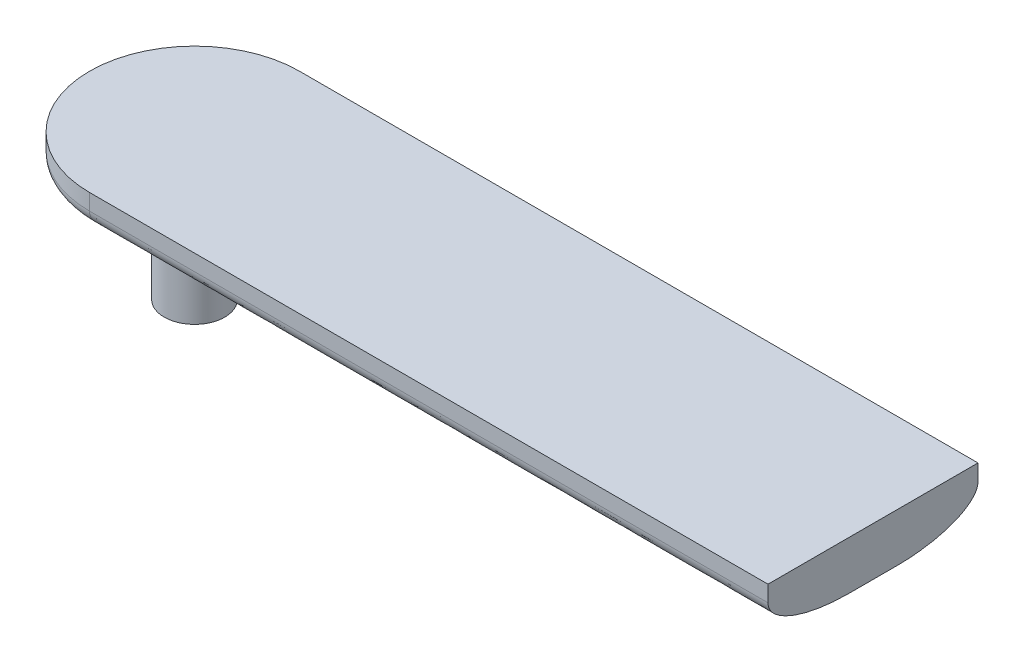
ISO-10303-21;
HEADER;
FILE_DESCRIPTION(('STEP AP214'),'2;1');
FILE_NAME('part.step','',(''),(''),'','','');
FILE_SCHEMA(('AUTOMOTIVE_DESIGN { 1 0 10303 214 1 1 1 1 }'));
ENDSEC;
DATA;
#1=APPLICATION_CONTEXT('core data for automotive mechanical design processes');
#2=APPLICATION_PROTOCOL_DEFINITION('international standard','automotive_design',2000,#1);
#3=PRODUCT_CONTEXT('',#1,'mechanical');
#4=PRODUCT('Part','Part','',(#3));
#5=PRODUCT_RELATED_PRODUCT_CATEGORY('part','',(#4));
#6=PRODUCT_DEFINITION_FORMATION('','',#4);
#7=PRODUCT_DEFINITION_CONTEXT('part definition',#1,'design');
#8=PRODUCT_DEFINITION('design','',#6,#7);
#9=PRODUCT_DEFINITION_SHAPE('','',#8);
#10=(LENGTH_UNIT() NAMED_UNIT(*) SI_UNIT(.MILLI.,.METRE.));
#11=(NAMED_UNIT(*) PLANE_ANGLE_UNIT() SI_UNIT($,.RADIAN.));
#12=(NAMED_UNIT(*) SI_UNIT($,.STERADIAN.) SOLID_ANGLE_UNIT());
#13=UNCERTAINTY_MEASURE_WITH_UNIT(LENGTH_MEASURE(1.E-05),#10,'distance_accuracy_value','');
#14=(GEOMETRIC_REPRESENTATION_CONTEXT(3) GLOBAL_UNCERTAINTY_ASSIGNED_CONTEXT((#13)) GLOBAL_UNIT_ASSIGNED_CONTEXT((#10,
#11,#12)) REPRESENTATION_CONTEXT('',''));
#15=CARTESIAN_POINT('',(0.,0.,0.));
#16=DIRECTION('',(0.,0.,1.));
#17=DIRECTION('',(1.,0.,0.));
#18=AXIS2_PLACEMENT_3D('',#15,#16,#17);
#19=CARTESIAN_POINT('',(0.,3.,0.));
#20=DIRECTION('',(0.,-1.,0.));
#21=DIRECTION('',(0.,0.,-1.));
#22=AXIS2_PLACEMENT_3D('',#19,#20,#21);
#23=CYLINDRICAL_SURFACE('',#22,6.50000000000001);
#24=DIRECTION('',(0.,-1.,0.));
#25=VECTOR('',#24,1.);
#26=CARTESIAN_POINT('',(0.,3.,-6.50000000000001));
#27=LINE('',#26,#25);
#28=CARTESIAN_POINT('',(0.,3.,-6.50000000000001));
#29=VERTEX_POINT('',#28);
#30=CARTESIAN_POINT('',(0.,2.,-6.50000000000001));
#31=VERTEX_POINT('',#30);
#32=EDGE_CURVE('E211',#29,#31,#27,.T.);
#33=ORIENTED_EDGE('',*,*,#32,.T.);
#34=CARTESIAN_POINT('',(0.,2.,6.50000000000001));
#35=CARTESIAN_POINT('',(-0.851001372194236,2.,6.50000000000001));
#36=CARTESIAN_POINT('',(-1.70136130656355,2.,6.33082237422514));
#37=CARTESIAN_POINT('',(-3.27352331418263,2.,5.6796115484216));
#38=CARTESIAN_POINT('',(-3.994553724403,2.,5.19783443102213));
#39=CARTESIAN_POINT('',(-5.19783443102215,2.,3.99455372440297));
#40=CARTESIAN_POINT('',(-5.67961154842164,2.,3.27352331418254));
#41=CARTESIAN_POINT('',(-6.33082237422511,2.,1.70136130656361));
#42=CARTESIAN_POINT('',(-6.50000000000001,2.,0.850847947321459));
#43=CARTESIAN_POINT('',(-6.50000000000001,2.,-0.850847947321462));
#44=CARTESIAN_POINT('',(-6.3308223742251,2.,-1.70136130656364));
#45=CARTESIAN_POINT('',(-5.67961154842162,2.,-3.27352331418256));
#46=CARTESIAN_POINT('',(-5.19783443102222,2.,-3.9945537244029));
#47=CARTESIAN_POINT('',(-3.99455372440289,2.,-5.19783443102223));
#48=CARTESIAN_POINT('',(-3.27352331418265,2.,-5.67961154842159));
#49=CARTESIAN_POINT('',(-1.70136130656348,2.,-6.33082237422516));
#50=CARTESIAN_POINT('',(-0.851001372194256,2.,-6.50000000000001));
#51=CARTESIAN_POINT('',(0.,2.,-6.50000000000001));
#52=(BOUNDED_CURVE() B_SPLINE_CURVE(3,(#34,#35,#36,#37,#38,#39,#40,#41,#42,#43,#44,#45,#46,#47,
#48,#49,#50,#51),.UNSPECIFIED.,.F.,.F.) B_SPLINE_CURVE_WITH_KNOTS((4,2,2,2,2,2,2,2,4),
(3.14159265358979,3.53429173528852,3.92699081698724,4.31968989868597,4.71238898038469,
5.10508806208341,5.49778714378214,5.89048622548086,6.28318530717959),
.UNSPECIFIED.) CURVE() GEOMETRIC_REPRESENTATION_ITEM() RATIONAL_B_SPLINE_CURVE((1.,1.,1.,1.,1.,
1.,1.,1.,1.,1.,1.,1.,1.,1.,1.,1.,1.,1.)) REPRESENTATION_ITEM(''));
#53=CARTESIAN_POINT('',(0.,2.,6.50000000000001));
#54=VERTEX_POINT('',#53);
#55=EDGE_CURVE('E299',#31,#54,#52,.F.);
#56=ORIENTED_EDGE('',*,*,#55,.T.);
#57=DIRECTION('',(0.,-1.,0.));
#58=VECTOR('',#57,1.);
#59=CARTESIAN_POINT('',(0.,3.,6.50000000000001));
#60=LINE('',#59,#58);
#61=CARTESIAN_POINT('',(0.,3.,6.50000000000001));
#62=VERTEX_POINT('',#61);
#63=EDGE_CURVE('E264',#62,#54,#60,.T.);
#64=ORIENTED_EDGE('',*,*,#63,.F.);
#65=CARTESIAN_POINT('',(0.,3.,0.));
#66=DIRECTION('',(0.,1.,0.));
#67=DIRECTION('',(0.,0.,1.));
#68=AXIS2_PLACEMENT_3D('',#65,#66,#67);
#69=CIRCLE('',#68,6.50000000000001);
#70=EDGE_CURVE('E197',#29,#62,#69,.T.);
#71=ORIENTED_EDGE('',*,*,#70,.F.);
#72=EDGE_LOOP('',(#33,#56,#64,#71));
#73=FACE_BOUND('',#72,.T.);
#74=ADVANCED_FACE('F56',(#73),#23,.T.);
#75=CARTESIAN_POINT('',(0.,3.,6.50000000000001));
#76=DIRECTION('',(0.,0.,-1.));
#77=DIRECTION('',(-1.,0.,0.));
#78=AXIS2_PLACEMENT_3D('',#75,#76,#77);
#79=PLANE('',#78);
#80=ORIENTED_EDGE('',*,*,#63,.T.);
#81=CARTESIAN_POINT('',(44.1,2.,6.5));
#82=CARTESIAN_POINT('',(29.4,2.,6.5));
#83=CARTESIAN_POINT('',(14.7,2.,6.5));
#84=CARTESIAN_POINT('',(0.,2.,6.50000000000001));
#85=(BOUNDED_CURVE() B_SPLINE_CURVE(3,(#81,#82,#83,#84),.UNSPECIFIED.,.F.,
.F.) B_SPLINE_CURVE_WITH_KNOTS((4,4),(0.,0.0441),
.UNSPECIFIED.) CURVE() GEOMETRIC_REPRESENTATION_ITEM() RATIONAL_B_SPLINE_CURVE((1.,1.,1.,1.)) REPRESENTATION_ITEM(''));
#86=CARTESIAN_POINT('',(42.,2.,6.5));
#87=VERTEX_POINT('',#86);
#88=EDGE_CURVE('E71',#54,#87,#85,.F.);
#89=ORIENTED_EDGE('',*,*,#88,.T.);
#90=DIRECTION('',(0.,-1.,0.));
#91=VECTOR('',#90,1.);
#92=CARTESIAN_POINT('',(42.,3.,6.5));
#93=LINE('',#92,#91);
#94=CARTESIAN_POINT('',(42.,3.,6.5));
#95=VERTEX_POINT('',#94);
#96=EDGE_CURVE('E275',#95,#87,#93,.T.);
#97=ORIENTED_EDGE('',*,*,#96,.F.);
#98=DIRECTION('',(1.,0.,0.));
#99=VECTOR('',#98,1.);
#100=CARTESIAN_POINT('',(0.,3.,6.50000000000001));
#101=LINE('',#100,#99);
#102=EDGE_CURVE('E201',#62,#95,#101,.T.);
#103=ORIENTED_EDGE('',*,*,#102,.F.);
#104=EDGE_LOOP('',(#80,#89,#97,#103));
#105=FACE_BOUND('',#104,.T.);
#106=ADVANCED_FACE('F250',(#105),#79,.F.);
#107=CARTESIAN_POINT('',(42.,3.,-6.5));
#108=DIRECTION('',(-1.,0.,0.));
#109=DIRECTION('',(0.,0.,1.));
#110=AXIS2_PLACEMENT_3D('',#107,#108,#109);
#111=PLANE('',#110);
#112=DIRECTION('',(0.,0.,-1.));
#113=VECTOR('',#112,1.);
#114=CARTESIAN_POINT('',(42.,0.,-6.5));
#115=LINE('',#114,#113);
#116=CARTESIAN_POINT('',(42.,0.,1.49999999999999));
#117=VERTEX_POINT('',#116);
#118=CARTESIAN_POINT('',(42.,0.,-1.5));
#119=VERTEX_POINT('',#118);
#120=EDGE_CURVE('E202',#117,#119,#115,.T.);
#121=ORIENTED_EDGE('',*,*,#120,.T.);
#122=CARTESIAN_POINT('',(42.,2.,-6.5));
#123=CARTESIAN_POINT('',(42.,0.,-6.5));
#124=CARTESIAN_POINT('',(42.,0.,-1.5));
#125=(BOUNDED_CURVE() B_SPLINE_CURVE(2,(#122,#123,#124),.UNSPECIFIED.,.F.,
.F.) B_SPLINE_CURVE_WITH_KNOTS((3,3),(0.,1.),
.UNSPECIFIED.) CURVE() GEOMETRIC_REPRESENTATION_ITEM() RATIONAL_B_SPLINE_CURVE((1.,
0.707106781186547,1.)) REPRESENTATION_ITEM(''));
#126=CARTESIAN_POINT('',(42.,2.,-6.5));
#127=VERTEX_POINT('',#126);
#128=EDGE_CURVE('E128',#119,#127,#125,.F.);
#129=ORIENTED_EDGE('',*,*,#128,.T.);
#130=DIRECTION('',(0.,-1.,0.));
#131=VECTOR('',#130,1.);
#132=CARTESIAN_POINT('',(42.,3.,-6.5));
#133=LINE('',#132,#131);
#134=CARTESIAN_POINT('',(42.,3.,-6.5));
#135=VERTEX_POINT('',#134);
#136=EDGE_CURVE('E285',#135,#127,#133,.T.);
#137=ORIENTED_EDGE('',*,*,#136,.F.);
#138=DIRECTION('',(0.,0.,-1.));
#139=VECTOR('',#138,1.);
#140=CARTESIAN_POINT('',(42.,3.,-6.5));
#141=LINE('',#140,#139);
#142=EDGE_CURVE('E205',#95,#135,#141,.T.);
#143=ORIENTED_EDGE('',*,*,#142,.F.);
#144=ORIENTED_EDGE('',*,*,#96,.T.);
#145=CARTESIAN_POINT('',(42.,0.,1.5));
#146=CARTESIAN_POINT('',(42.,0.,6.50000000000012));
#147=CARTESIAN_POINT('',(42.,2.,6.5));
#148=(BOUNDED_CURVE() B_SPLINE_CURVE(2,(#145,#146,#147),.UNSPECIFIED.,.F.,
.F.) B_SPLINE_CURVE_WITH_KNOTS((3,3),(0.,1.),
.UNSPECIFIED.) CURVE() GEOMETRIC_REPRESENTATION_ITEM() RATIONAL_B_SPLINE_CURVE((1.,
0.707106781186548,1.)) REPRESENTATION_ITEM(''));
#149=EDGE_CURVE('E135',#87,#117,#148,.F.);
#150=ORIENTED_EDGE('',*,*,#149,.T.);
#151=EDGE_LOOP('',(#121,#129,#137,#143,#144,#150));
#152=FACE_BOUND('',#151,.T.);
#153=ADVANCED_FACE('F245',(#152),#111,.F.);
#154=CARTESIAN_POINT('',(0.,3.,-6.50000000000001));
#155=DIRECTION('',(0.,0.,1.));
#156=DIRECTION('',(1.,0.,0.));
#157=AXIS2_PLACEMENT_3D('',#154,#155,#156);
#158=PLANE('',#157);
#159=ORIENTED_EDGE('',*,*,#136,.T.);
#160=CARTESIAN_POINT('',(0.,2.,-6.50000000000001));
#161=CARTESIAN_POINT('',(14.7,2.,-6.5));
#162=CARTESIAN_POINT('',(29.4000000000001,2.,-6.5));
#163=CARTESIAN_POINT('',(44.1,2.,-6.5));
#164=(BOUNDED_CURVE() B_SPLINE_CURVE(3,(#160,#161,#162,#163),.UNSPECIFIED.,.F.,
.F.) B_SPLINE_CURVE_WITH_KNOTS((4,4),(-0.0441,0.),
.UNSPECIFIED.) CURVE() GEOMETRIC_REPRESENTATION_ITEM() RATIONAL_B_SPLINE_CURVE((1.,1.,1.,1.)) REPRESENTATION_ITEM(''));
#165=EDGE_CURVE('E274',#127,#31,#164,.F.);
#166=ORIENTED_EDGE('',*,*,#165,.T.);
#167=ORIENTED_EDGE('',*,*,#32,.F.);
#168=DIRECTION('',(-1.,0.,0.));
#169=VECTOR('',#168,1.);
#170=CARTESIAN_POINT('',(0.,3.,-6.50000000000001));
#171=LINE('',#170,#169);
#172=EDGE_CURVE('E208',#135,#29,#171,.T.);
#173=ORIENTED_EDGE('',*,*,#172,.F.);
#174=EDGE_LOOP('',(#159,#166,#167,#173));
#175=FACE_BOUND('',#174,.T.);
#176=ADVANCED_FACE('F240',(#175),#158,.F.);
#177=CARTESIAN_POINT('',(0.,3.,0.));
#178=DIRECTION('',(0.,1.,0.));
#179=DIRECTION('',(0.,0.,1.));
#180=AXIS2_PLACEMENT_3D('',#177,#178,#179);
#181=PLANE('',#180);
#182=ORIENTED_EDGE('',*,*,#70,.T.);
#183=ORIENTED_EDGE('',*,*,#102,.T.);
#184=ORIENTED_EDGE('',*,*,#142,.T.);
#185=ORIENTED_EDGE('',*,*,#172,.T.);
#186=EDGE_LOOP('',(#182,#183,#184,#185));
#187=FACE_BOUND('',#186,.T.);
#188=ADVANCED_FACE('F239',(#187),#181,.T.);
#189=CARTESIAN_POINT('',(0.,0.,0.));
#190=DIRECTION('',(0.,1.,0.));
#191=DIRECTION('',(0.,0.,1.));
#192=AXIS2_PLACEMENT_3D('',#189,#190,#191);
#193=PLANE('',#192);
#194=CARTESIAN_POINT('',(0.,0.,1.50000000000001));
#195=CARTESIAN_POINT('',(14.7,0.,1.50000000000001));
#196=CARTESIAN_POINT('',(29.4000000000001,0.,1.5));
#197=CARTESIAN_POINT('',(44.1,0.,1.5));
#198=(BOUNDED_CURVE() B_SPLINE_CURVE(3,(#194,#195,#196,#197),.UNSPECIFIED.,.F.,
.F.) B_SPLINE_CURVE_WITH_KNOTS((4,4),(0.,0.0441),
.UNSPECIFIED.) CURVE() GEOMETRIC_REPRESENTATION_ITEM() RATIONAL_B_SPLINE_CURVE((1.,1.,1.,1.)) REPRESENTATION_ITEM(''));
#199=CARTESIAN_POINT('',(1.12499999999999,0.,1.50000000000001));
#200=VERTEX_POINT('',#199);
#201=EDGE_CURVE('E136',#117,#200,#198,.F.);
#202=ORIENTED_EDGE('',*,*,#201,.T.);
#203=CARTESIAN_POINT('',(0.,0.,0.));
#204=DIRECTION('',(0.,1.,0.));
#205=DIRECTION('',(0.,0.,1.));
#206=AXIS2_PLACEMENT_3D('',#203,#204,#205);
#207=CIRCLE('',#206,1.875);
#208=CARTESIAN_POINT('',(1.125,0.,-1.50000000000001));
#209=VERTEX_POINT('',#208);
#210=EDGE_CURVE('E140',#200,#209,#207,.T.);
#211=ORIENTED_EDGE('',*,*,#210,.T.);
#212=CARTESIAN_POINT('',(44.1,0.,-1.5));
#213=CARTESIAN_POINT('',(29.4,0.,-1.5));
#214=CARTESIAN_POINT('',(14.7,0.,-1.50000000000001));
#215=CARTESIAN_POINT('',(0.,0.,-1.50000000000001));
#216=(BOUNDED_CURVE() B_SPLINE_CURVE(3,(#212,#213,#214,#215),.UNSPECIFIED.,.F.,
.F.) B_SPLINE_CURVE_WITH_KNOTS((4,4),(-0.0441,0.),
.UNSPECIFIED.) CURVE() GEOMETRIC_REPRESENTATION_ITEM() RATIONAL_B_SPLINE_CURVE((1.,1.,1.,1.)) REPRESENTATION_ITEM(''));
#217=EDGE_CURVE('E123',#209,#119,#216,.F.);
#218=ORIENTED_EDGE('',*,*,#217,.T.);
#219=ORIENTED_EDGE('',*,*,#120,.F.);
#220=EDGE_LOOP('',(#202,#211,#218,#219));
#221=FACE_BOUND('',#220,.T.);
#222=ADVANCED_FACE('F141',(#221),#193,.F.);
#223=CARTESIAN_POINT('',(0.,2.,6.50000000000001));
#224=CARTESIAN_POINT('',(14.7,2.,6.5));
#225=CARTESIAN_POINT('',(29.4,2.,6.5));
#226=CARTESIAN_POINT('',(44.1,2.,6.5));
#227=CARTESIAN_POINT('',(0.,0.,6.50000000000001));
#228=CARTESIAN_POINT('',(14.7,0.,6.50000000001913));
#229=CARTESIAN_POINT('',(29.4,0.,6.5));
#230=CARTESIAN_POINT('',(44.1,0.,6.5));
#231=CARTESIAN_POINT('',(0.,0.,1.50000000000001));
#232=CARTESIAN_POINT('',(14.7,0.,1.50000000000001));
#233=CARTESIAN_POINT('',(29.4000000000001,0.,1.5));
#234=CARTESIAN_POINT('',(44.1,0.,1.5));
#235=(BOUNDED_SURFACE() B_SPLINE_SURFACE(2,3,((#223,#224,#225,#226),(#227,#228,#229,#230),(#231,
#232,#233,#234)),.UNSPECIFIED.,.F.,.F.,.F.) B_SPLINE_SURFACE_WITH_KNOTS((3,3),(4,4),(0.,1.),(0.,
0.0441),.UNSPECIFIED.) GEOMETRIC_REPRESENTATION_ITEM() RATIONAL_B_SPLINE_SURFACE(((1.,1.,1.,1.),
(0.707106781186548,0.707106781186548,0.707106781186548,0.707106781186548),(1.,1.,1.,1.))) REPRESENTATION_ITEM('') SURFACE());
#236=CARTESIAN_POINT('',(1.125,0.,1.5));
#237=CARTESIAN_POINT('',(1.08225485051735,6.35894111764792E-07,1.53205912897573));
#238=CARTESIAN_POINT('',(1.03815852674023,0.000123214076618437,1.56227460316092));
#239=CARTESIAN_POINT('',(0.947551185718617,0.000532851846042419,1.61883478473993));
#240=CARTESIAN_POINT('',(0.901040199880472,0.000819909294144235,1.64517954246123));
#241=CARTESIAN_POINT('',(0.760906049169837,0.00179075446079096,1.71680932329486));
#242=CARTESIAN_POINT('',(0.66431929076687,0.00259302434332911,1.75644977781796));
#243=CARTESIAN_POINT('',(0.474990917125596,0.00397312223199153,1.81630271402513));
#244=CARTESIAN_POINT('',(0.382700488486839,0.00456473803426025,1.83795599782052));
#245=CARTESIAN_POINT('',(0.241517176000286,0.00518907542136395,1.86001167535376));
#246=CARTESIAN_POINT('',(0.193394628550247,0.00535365933357526,1.86562781915161));
#247=CARTESIAN_POINT('',(0.0968533399330548,0.00557632297517966,1.87312278992451));
#248=CARTESIAN_POINT('',(0.0484345640212485,0.0056343899612352,1.87500116972793));
#249=CARTESIAN_POINT('',(0.,0.00563293248208677,1.875));
#250=B_SPLINE_CURVE_WITH_KNOTS('',3,(#236,#237,#238,#239,#240,#241,#242,#243,#244,#245,#246,
#247,#248,#249),.UNSPECIFIED.,.F.,.F.,(4,2,2,2,2,2,4),(0.,0.160195850046238,0.320389617023893,
0.632052607907571,0.915325698601855,1.06054426091576,1.20578019557191),.UNSPECIFIED.);
#251=CARTESIAN_POINT('',(0.,0.00563293248211989,1.8750000000011));
#252=VERTEX_POINT('',#251);
#253=EDGE_CURVE('E78',#200,#252,#250,.T.);
#254=CARTESIAN_POINT('',(0.,0.00563293248211185,1.87500000000083));
#255=CARTESIAN_POINT('',(0.,0.0100159913580478,2.0200537144502));
#256=CARTESIAN_POINT('',(0.,0.016906470196642,2.16504040237938));
#257=CARTESIAN_POINT('',(0.,0.0360677273612441,2.45705111480915));
#258=CARTESIAN_POINT('',(0.,0.0484251112457488,2.60406943870534));
#259=CARTESIAN_POINT('',(0.,0.0788360141765979,2.89829651518684));
#260=CARTESIAN_POINT('',(0.,0.0969189335704366,3.04550225501309));
#261=CARTESIAN_POINT('',(0.,0.139006974688029,3.33804837175091));
#262=CARTESIAN_POINT('',(0.,0.162970900574907,3.4833946243415));
#263=CARTESIAN_POINT('',(0.,0.216899296210555,3.77003175262212));
#264=CARTESIAN_POINT('',(0.,0.246737106759962,3.91134631466665));
#265=CARTESIAN_POINT('',(0.,0.31233975793724,4.18770523730118));
#266=CARTESIAN_POINT('',(0.,0.34787692584282,4.32280278235622));
#267=CARTESIAN_POINT('',(0.,0.406174829976709,4.52153623877795));
#268=CARTESIAN_POINT('',(0.,0.426048463049852,4.58602530440906));
#269=CARTESIAN_POINT('',(0.,0.467137211502803,4.71263799587937));
#270=CARTESIAN_POINT('',(0.,0.488301009148441,4.77477819045573));
#271=CARTESIAN_POINT('',(0.,0.531907651732776,4.89644950385587));
#272=CARTESIAN_POINT('',(0.,0.554290847272891,4.95600194933472));
#273=CARTESIAN_POINT('',(0.,0.600267337261173,5.07227227799035));
#274=CARTESIAN_POINT('',(0.,0.623792293357427,5.12901709515418));
#275=CARTESIAN_POINT('',(0.,0.671974730415255,5.23946545245847));
#276=CARTESIAN_POINT('',(0.,0.69655503553175,5.29320254750699));
#277=CARTESIAN_POINT('',(0.,0.746763664450484,5.39745031678017));
#278=CARTESIAN_POINT('',(0.,0.772305976507438,5.44800226447401));
#279=CARTESIAN_POINT('',(0.,0.824347853430724,5.54571769696853));
#280=CARTESIAN_POINT('',(0.,0.850752825165876,5.59293136835693));
#281=CARTESIAN_POINT('',(0.,0.904424441705554,5.68383333785237));
#282=CARTESIAN_POINT('',(0.,0.931588470357913,5.72758194880157));
#283=CARTESIAN_POINT('',(0.,0.986677359209,5.8114408600766));
#284=CARTESIAN_POINT('',(0.,1.01449263074844,5.85162289311104));
#285=CARTESIAN_POINT('',(0.,1.07078360299574,5.92826747847677));
#286=CARTESIAN_POINT('',(0.,1.09914408209288,5.96481396803714));
#287=CARTESIAN_POINT('',(0.,1.14270625534391,6.01753025778066));
#288=CARTESIAN_POINT('',(0.,1.15706727576795,6.03439803725044));
#289=CARTESIAN_POINT('',(0.,1.18589874496905,6.06719474811608));
#290=CARTESIAN_POINT('',(0.,1.20035430134608,6.08313673294615));
#291=CARTESIAN_POINT('',(0.,1.22936049796674,6.11407908359039));
#292=CARTESIAN_POINT('',(0.,1.24389629623517,6.12909334772808));
#293=CARTESIAN_POINT('',(0.,1.27304940291057,6.15817958208913));
#294=CARTESIAN_POINT('',(0.,1.28765201349714,6.17226626007239));
#295=CARTESIAN_POINT('',(0.,1.3169249986224,6.19949814800859));
#296=CARTESIAN_POINT('',(0.,1.33158095097667,6.2126588370207));
#297=CARTESIAN_POINT('',(0.,1.3609469733145,6.23804119741017));
#298=CARTESIAN_POINT('',(0.,1.37564302986127,6.25027905488794));
#299=CARTESIAN_POINT('',(0.,1.405075674917,6.27381976375972));
#300=CARTESIAN_POINT('',(0.,1.41979879953404,6.28513942030392));
#301=CARTESIAN_POINT('',(0.,1.44927209768738,6.30684928219621));
#302=CARTESIAN_POINT('',(0.,1.46400949920079,6.3172567963434));
#303=CARTESIAN_POINT('',(0.,1.4934979945088,6.33714943963428));
#304=CARTESIAN_POINT('',(0.,1.50823714757874,6.34665223736915));
#305=CARTESIAN_POINT('',(0.,1.53771594820113,6.36474399379023));
#306=CARTESIAN_POINT('',(0.,1.55244461665789,6.37335080844269));
#307=CARTESIAN_POINT('',(0.,1.58188944461138,6.38966058836141));
#308=CARTESIAN_POINT('',(0.,1.59659570103666,6.39738139782987));
#309=CARTESIAN_POINT('',(0.,1.62598293685511,6.41193055980251));
#310=CARTESIAN_POINT('',(0.,1.64065518037805,6.41877652291559));
#311=CARTESIAN_POINT('',(0.,1.66996190411823,6.43158873885721));
#312=CARTESIAN_POINT('',(0.,1.68458887656765,6.43757213070164));
#313=CARTESIAN_POINT('',(0.,1.71379290492091,6.44867324869938));
#314=CARTESIAN_POINT('',(0.,1.7283637057237,6.45380739703923));
#315=CARTESIAN_POINT('',(0.,1.75744362638101,6.46322529795299));
#316=CARTESIAN_POINT('',(0.,1.77194772779059,6.46752451459334));
#317=CARTESIAN_POINT('',(0.,1.80088292846251,6.47528897990027));
#318=CARTESIAN_POINT('',(0.,1.81531018783454,6.47876850924063));
#319=CARTESIAN_POINT('',(0.,1.84408089026545,6.48491103968322));
#320=CARTESIAN_POINT('',(0.,1.85842157323604,6.48758694272924));
#321=CARTESIAN_POINT('',(0.,1.88700883518381,6.49214074919673));
#322=CARTESIAN_POINT('',(0.,1.90125360018768,6.49403001814144));
#323=CARTESIAN_POINT('',(0.,1.92963941976892,6.49702938118472));
#324=CARTESIAN_POINT('',(0.,1.94377944395069,6.49814920612011));
#325=CARTESIAN_POINT('',(0.,1.97194647484034,6.49963113830935));
#326=CARTESIAN_POINT('',(0.,1.98597306047225,6.50000126913098));
#327=CARTESIAN_POINT('',(0.,2.,6.50000000000001));
#328=B_SPLINE_CURVE_WITH_KNOTS('',3,(#254,#255,#256,#257,#258,#259,#260,#261,#262,#263,#264,
#265,#266,#267,#268,#269,#270,#271,#272,#273,#274,#275,#276,#277,#278,#279,#280,#281,#282,#283,
#284,#285,#286,#287,#288,#289,#290,#291,#292,#293,#294,#295,#296,#297,#298,#299,#300,#301,#302,
#303,#304,#305,#306,#307,#308,#309,#310,#311,#312,#313,#314,#315,#316,#317,#318,#319,#320,#321,
#322,#323,#324,#325,#326,#327),.UNSPECIFIED.,.F.,.F.,(4,2,2,2,2,2,2,2,2,2,2,2,2,2,2,2,2,2,2,2,2,
2,2,2,2,2,2,2,2,2,2,2,2,2,2,2,4),(0.,0.435351184767002,0.877860873417624,1.32268072024933,
1.76446939522444,2.19760903555469,2.61647770722602,2.81889924063801,3.01580437596101,
3.20663127656479,3.39087822842996,3.56811308458848,3.73798205096217,3.90021768853215,
4.05464603120631,4.20119273121824,4.33988813208343,4.40633842848325,4.47088710392531,
4.53356889247926,4.59442550484947,4.65350558632062,4.71086462723115,4.76656481764902,
4.82067483692205,4.87326956812635,4.92442972737065,4.97424139868909,5.02279546712349,
5.07018694576089,5.11651419703802,5.16187805445564,5.20638085762935,5.25012542075403,
5.29321396127792,5.33574702096437,5.37782241471406),.UNSPECIFIED.);
#329=EDGE_CURVE('E219',#252,#54,#328,.T.);
#330=ORIENTED_EDGE('',*,*,#253,.F.);
#331=ORIENTED_EDGE('',*,*,#201,.F.);
#332=ORIENTED_EDGE('',*,*,#149,.F.);
#333=ORIENTED_EDGE('',*,*,#88,.F.);
#334=ORIENTED_EDGE('',*,*,#329,.F.);
#335=EDGE_LOOP('',(#330,#331,#332,#333,#334));
#336=FACE_BOUND('',#335,.T.);
#337=ADVANCED_FACE('F59',(#336),#235,.T.);
#338=CARTESIAN_POINT('',(0.,2.,-6.50000000000001));
#339=CARTESIAN_POINT('',(-0.851001372194256,2.,-6.50000000000001));
#340=CARTESIAN_POINT('',(-1.70136130656348,2.,-6.33082237422516));
#341=CARTESIAN_POINT('',(-3.27352331418265,2.,-5.67961154842159));
#342=CARTESIAN_POINT('',(-3.99455372440289,2.,-5.19783443102223));
#343=CARTESIAN_POINT('',(-5.19783443102222,2.,-3.9945537244029));
#344=CARTESIAN_POINT('',(-5.67961154842162,2.,-3.27352331418256));
#345=CARTESIAN_POINT('',(-6.3308223742251,2.,-1.70136130656364));
#346=CARTESIAN_POINT('',(-6.50000000000001,2.,-0.850847947321462));
#347=CARTESIAN_POINT('',(-6.50000000000001,2.,0.850847947321459));
#348=CARTESIAN_POINT('',(-6.33082237422511,2.,1.70136130656361));
#349=CARTESIAN_POINT('',(-5.67961154842164,2.,3.27352331418254));
#350=CARTESIAN_POINT('',(-5.19783443102215,2.,3.99455372440297));
#351=CARTESIAN_POINT('',(-3.994553724403,2.,5.19783443102213));
#352=CARTESIAN_POINT('',(-3.27352331418263,2.,5.6796115484216));
#353=CARTESIAN_POINT('',(-1.70136130656355,2.,6.33082237422514));
#354=CARTESIAN_POINT('',(-0.851001372194236,2.,6.50000000000001));
#355=CARTESIAN_POINT('',(0.,2.,6.50000000000001));
#356=CARTESIAN_POINT('',(0.,0.,-6.50000000000001));
#357=CARTESIAN_POINT('',(-0.851001372194278,-5.11010252214275E-13,-6.49999999993851));
#358=CARTESIAN_POINT('',(-1.70136130656338,0.,-6.33082237422484));
#359=CARTESIAN_POINT('',(-3.27352331418276,0.,-5.67961154842192));
#360=CARTESIAN_POINT('',(-3.99455372440285,0.,-5.19783443102219));
#361=CARTESIAN_POINT('',(-5.19783443102226,0.,-3.99455372440295));
#362=CARTESIAN_POINT('',(-5.67961154842156,0.,-3.27352331418254));
#363=CARTESIAN_POINT('',(-6.33082237422516,0.,-1.70136130656366));
#364=CARTESIAN_POINT('',(-6.50000000000001,0.,-0.850847947321462));
#365=CARTESIAN_POINT('',(-6.50000000000001,0.,0.850847947321459));
#366=CARTESIAN_POINT('',(-6.33082237422517,0.,1.70136130656364));
#367=CARTESIAN_POINT('',(-5.67961154842158,0.,3.27352331418251));
#368=CARTESIAN_POINT('',(-5.19783443102211,0.,3.99455372440284));
#369=CARTESIAN_POINT('',(-3.99455372440304,0.,5.19783443102226));
#370=CARTESIAN_POINT('',(-3.2735233141827,0.,5.67961154842174));
#371=CARTESIAN_POINT('',(-1.70136130656348,0.,6.33082237422499));
#372=CARTESIAN_POINT('',(-0.851001372194227,-5.11010252213963E-13,6.49999999993851));
#373=CARTESIAN_POINT('',(0.,0.,6.50000000000001));
#374=CARTESIAN_POINT('',(0.,0.,-1.50000000000001));
#375=CARTESIAN_POINT('',(-0.196384932044809,0.,-1.49999999998544));
#376=CARTESIAN_POINT('',(-0.392621839976198,0.,-1.46095900943657));
#377=CARTESIAN_POINT('',(-0.755428457119067,0.,-1.3106795880973));
#378=CARTESIAN_POINT('',(-0.921820090246812,0.,-1.19950025331282));
#379=CARTESIAN_POINT('',(-1.19950025331284,0.,-0.921820090246835));
#380=CARTESIAN_POINT('',(-1.3106795880973,0.,-0.755428457119064));
#381=CARTESIAN_POINT('',(-1.46095900943657,0.,-0.392621839976216));
#382=CARTESIAN_POINT('',(-1.50000000000001,0.,-0.196349526304953));
#383=CARTESIAN_POINT('',(-1.50000000000001,0.,0.196349526304953));
#384=CARTESIAN_POINT('',(-1.46095900943655,0.,0.392621839976211));
#385=CARTESIAN_POINT('',(-1.31067958809732,0.,0.755428457119059));
#386=CARTESIAN_POINT('',(-1.19950025331282,0.,0.921820090246852));
#387=CARTESIAN_POINT('',(-0.921820090246837,0.,1.19950025331279));
#388=CARTESIAN_POINT('',(-0.755428457119072,0.,1.31067958809728));
#389=CARTESIAN_POINT('',(-0.392621839976203,0.,1.46095900943659));
#390=CARTESIAN_POINT('',(-0.196384932044812,0.,1.49999999998544));
#391=CARTESIAN_POINT('',(0.,0.,1.50000000000001));
#392=(BOUNDED_SURFACE() B_SPLINE_SURFACE(2,3,((#338,#339,#340,#341,#342,#343,#344,#345,#346,
#347,#348,#349,#350,#351,#352,#353,#354,#355),(#356,#357,#358,#359,#360,#361,#362,#363,#364,
#365,#366,#367,#368,#369,#370,#371,#372,#373),(#374,#375,#376,#377,#378,#379,#380,#381,#382,
#383,#384,#385,#386,#387,#388,#389,#390,#391)),.UNSPECIFIED.,.F.,.F.,
.F.) B_SPLINE_SURFACE_WITH_KNOTS((3,3),(4,2,2,2,2,2,2,2,4),(0.,1.),(3.14159265358979,
3.53429173528852,3.92699081698724,4.31968989868597,4.71238898038469,5.10508806208341,
5.49778714378214,5.89048622548086,6.28318530717959),
.UNSPECIFIED.) GEOMETRIC_REPRESENTATION_ITEM() RATIONAL_B_SPLINE_SURFACE(((1.,1.,1.,1.,1.,1.,1.,
1.,1.,1.,1.,1.,1.,1.,1.,1.,1.,1.),(0.707106781186548,0.707106781186548,0.707106781186548,
0.707106781186548,0.707106781186548,0.707106781186548,0.707106781186548,0.707106781186548,
0.707106781186548,0.707106781186548,0.707106781186548,0.707106781186548,0.707106781186548,
0.707106781186548,0.707106781186548,0.707106781186548,0.707106781186548,0.707106781186548),(1.,
1.,1.,1.,1.,1.,1.,1.,1.,1.,1.,1.,1.,1.,1.,1.,1.,1.))) REPRESENTATION_ITEM('') SURFACE());
#393=CARTESIAN_POINT('',(0.,0.00563293248208676,1.875));
#394=CARTESIAN_POINT('',(-0.0527512712908862,0.00563295927086436,1.87499964976341));
#395=CARTESIAN_POINT('',(-0.105477269462089,0.0056336982787506,1.87277244658728));
#396=CARTESIAN_POINT('',(-0.210551990876004,0.005635237403602,1.86388722567801));
#397=CARTESIAN_POINT('',(-0.262900732062069,0.00563603751763951,1.85722942010101));
#398=CARTESIAN_POINT('',(-0.418732557837007,0.00563648444887623,1.83067241251974));
#399=CARTESIAN_POINT('',(-0.52117176778701,0.00563418664058342,1.80418945055784));
#400=CARTESIAN_POINT('',(-0.72014537365266,0.00563325618023213,1.73440232740993));
#401=CARTESIAN_POINT('',(-0.816677005893445,0.00563462523039274,1.69109036188817));
#402=CARTESIAN_POINT('',(-1.00109391095819,0.00563593175767997,1.58888050641052));
#403=CARTESIAN_POINT('',(-1.08898087778524,0.00563586951584518,1.52998567844252));
#404=CARTESIAN_POINT('',(-1.25361897760891,0.00563455235426513,1.39827761532373));
#405=CARTESIAN_POINT('',(-1.33036986507129,0.00563329740822711,1.32546407336769));
#406=CARTESIAN_POINT('',(-1.47057074808173,0.00563432409290564,1.16797365025889));
#407=CARTESIAN_POINT('',(-1.53401871624133,0.00563660626224072,1.08329496411306));
#408=CARTESIAN_POINT('',(-1.64579377775129,0.00563589798130485,0.904490865157697));
#409=CARTESIAN_POINT('',(-1.6941215384641,0.00563290776378056,0.81036586952335));
#410=CARTESIAN_POINT('',(-1.77428589571616,0.00563296233204176,0.615344434349172));
#411=CARTESIAN_POINT('',(-1.80612354717511,0.00563600673171528,0.51444842843691));
#412=CARTESIAN_POINT('',(-1.85240879650596,0.00563660381021241,0.308741154973135));
#413=CARTESIAN_POINT('',(-1.86685603797346,0.00563415637648766,0.203929807224793));
#414=CARTESIAN_POINT('',(-1.87795019556758,0.00563320072804408,-0.00663238383960206));
#415=CARTESIAN_POINT('',(-1.87459670226892,0.00563469260393084,-0.112383248709141));
#416=CARTESIAN_POINT('',(-1.85018048273008,0.00563599568314397,-0.321822833882774));
#417=CARTESIAN_POINT('',(-1.8291179320847,0.00563580690313477,-0.425511574623497));
#418=CARTESIAN_POINT('',(-1.76989404856545,0.00563447833450092,-0.627870010128562));
#419=CARTESIAN_POINT('',(-1.7317327699367,0.0056333385488933,-0.726539720814492));
#420=CARTESIAN_POINT('',(-1.63934792055189,0.00563442012716816,-0.916115135637763));
#421=CARTESIAN_POINT('',(-1.58512392886142,0.00563664157914046,-1.00702063622822));
#422=CARTESIAN_POINT('',(-1.49301262415329,0.00563601183285095,-1.13548481781694));
#423=CARTESIAN_POINT('',(-1.46050619292342,0.00563514108652548,-1.17699725029138));
#424=CARTESIAN_POINT('',(-1.39208438235035,0.00563358953593084,-1.25718166896443));
#425=CARTESIAN_POINT('',(-1.35616574345434,0.00563290891577742,-1.2958508753103));
#426=CARTESIAN_POINT('',(-1.24375229951343,0.00563300979156487,-1.40705132385183));
#427=CARTESIAN_POINT('',(-1.16251724866254,0.00563592653494552,-1.47489051583618));
#428=CARTESIAN_POINT('',(-0.989799447949539,0.00563672968625374,-1.59594533741581));
#429=CARTESIAN_POINT('',(-0.898317088020481,0.00563461628552765,-1.64916152318329));
#430=CARTESIAN_POINT('',(-0.755411408522084,0.00563311270009471,-1.71690847122577));
#431=CARTESIAN_POINT('',(-0.706775644771315,0.00563288989564417,-1.73749299058293));
#432=CARTESIAN_POINT('',(-0.607969625309352,0.00563366491879728,-1.7744786611846));
#433=CARTESIAN_POINT('',(-0.557800649578399,0.00563466175395385,-1.79088320065147));
#434=CARTESIAN_POINT('',(-0.4563130764241,0.00563602355363854,-1.81939010620944));
#435=CARTESIAN_POINT('',(-0.404995656779537,0.00563638913794011,-1.83149668282723));
#436=CARTESIAN_POINT('',(-0.301532980135839,0.00563623505303863,-1.85134424316104));
#437=CARTESIAN_POINT('',(-0.249387970234597,0.00563571564332377,-1.85908650564734));
#438=CARTESIAN_POINT('',(-0.164274606736397,0.0056345732362802,-1.86808022599035));
#439=CARTESIAN_POINT('',(-0.131442455311391,0.00563406199155561,-1.87067679236975));
#440=CARTESIAN_POINT('',(-0.0657413583316816,0.00563325108299565,-1.87413542536181));
#441=CARTESIAN_POINT('',(-0.0328725633310836,0.00563295107078146,-1.8750003522754));
#442=CARTESIAN_POINT('',(0.,0.00563293248208676,-1.875));
#443=B_SPLINE_CURVE_WITH_KNOTS('',3,(#393,#394,#395,#396,#397,#398,#399,#400,#401,#402,#403,
#404,#405,#406,#407,#408,#409,#410,#411,#412,#413,#414,#415,#416,#417,#418,#419,#420,#421,#422,
#423,#424,#425,#426,#427,#428,#429,#430,#431,#432,#433,#434,#435,#436,#437,#438,#439,#440,#441,
#442),.UNSPECIFIED.,.F.,.F.,(4,2,2,2,2,2,2,2,2,2,2,2,2,2,2,2,2,2,2,2,2,2,2,2,4),(0.,
0.158156610221171,0.31630564777459,0.63209866461346,0.948038303435624,1.26391590706788,
1.57980047428071,1.89573314792401,2.21165187524026,2.5275503898299,2.8434553784303,
3.1593676330258,3.47527675521885,3.79118487520842,4.10710127451926,4.26511599573614,
4.42328321006875,4.739197839716,5.05510045218569,5.21338111523804,5.37153306751292,
5.52952965487483,5.68747992419071,5.78624201177341,5.8848408303072),.UNSPECIFIED.);
#444=CARTESIAN_POINT('',(0.,0.00563293248211989,-1.8750000000011));
#445=VERTEX_POINT('',#444);
#446=EDGE_CURVE('E86',#252,#445,#443,.T.);
#447=CARTESIAN_POINT('',(0.,0.,-1.50000000000001));
#448=CARTESIAN_POINT('',(0.,0.,-6.50000000000001));
#449=CARTESIAN_POINT('',(0.,2.,-6.50000000000001));
#450=(BOUNDED_CURVE() B_SPLINE_CURVE(2,(#447,#448,#449),.UNSPECIFIED.,.F.,
.F.) B_SPLINE_CURVE_WITH_KNOTS((3,3),(0.,1.),
.UNSPECIFIED.) CURVE() GEOMETRIC_REPRESENTATION_ITEM() RATIONAL_B_SPLINE_CURVE((1.,
0.707106781186548,1.)) REPRESENTATION_ITEM(''));
#451=EDGE_CURVE('E145',#445,#31,#450,.T.);
#452=ORIENTED_EDGE('',*,*,#446,.F.);
#453=ORIENTED_EDGE('',*,*,#329,.T.);
#454=ORIENTED_EDGE('',*,*,#55,.F.);
#455=ORIENTED_EDGE('',*,*,#451,.F.);
#456=EDGE_LOOP('',(#452,#453,#454,#455));
#457=FACE_BOUND('',#456,.T.);
#458=ADVANCED_FACE('F167',(#457),#392,.T.);
#459=CARTESIAN_POINT('',(44.1,2.,-6.5));
#460=CARTESIAN_POINT('',(29.4000000000001,2.,-6.5));
#461=CARTESIAN_POINT('',(14.7,2.,-6.5));
#462=CARTESIAN_POINT('',(0.,2.,-6.50000000000001));
#463=CARTESIAN_POINT('',(44.1,0.,-6.5));
#464=CARTESIAN_POINT('',(29.4,0.,-6.5));
#465=CARTESIAN_POINT('',(14.7,0.,-6.50000000000001));
#466=CARTESIAN_POINT('',(0.,0.,-6.50000000000001));
#467=CARTESIAN_POINT('',(44.1,0.,-1.5));
#468=CARTESIAN_POINT('',(29.4,0.,-1.5));
#469=CARTESIAN_POINT('',(14.7,0.,-1.50000000000001));
#470=CARTESIAN_POINT('',(0.,0.,-1.50000000000001));
#471=(BOUNDED_SURFACE() B_SPLINE_SURFACE(2,3,((#459,#460,#461,#462),(#463,#464,#465,#466),(#467,
#468,#469,#470)),.UNSPECIFIED.,.F.,.F.,.F.) B_SPLINE_SURFACE_WITH_KNOTS((3,3),(4,4),(0.,1.),
(-0.0441,0.),.UNSPECIFIED.) GEOMETRIC_REPRESENTATION_ITEM() RATIONAL_B_SPLINE_SURFACE(((1.,1.,
1.,1.),(0.707106781186548,0.707106781186548,0.707106781186548,0.707106781186548),(1.,1.,1.,1.))) REPRESENTATION_ITEM('') SURFACE());
#472=CARTESIAN_POINT('',(0.,0.00563293248208676,-1.875));
#473=CARTESIAN_POINT('',(0.0534323373261163,0.00563500836972617,-1.8750002200424));
#474=CARTESIAN_POINT('',(0.106839680962009,0.00556396593652638,-1.87271473138242));
#475=CARTESIAN_POINT('',(0.213263983959039,0.00529390259278681,-1.86359810932754));
#476=CARTESIAN_POINT('',(0.266280947861805,0.00509488317350206,-1.85676702890025));
#477=CARTESIAN_POINT('',(0.421369947106821,0.00434707038135721,-1.82998910443613));
#478=CARTESIAN_POINT('',(0.522426084444006,0.00364548415109784,-1.80374808131769));
#479=CARTESIAN_POINT('',(0.70979988479845,0.00222907525585316,-1.73803216604934));
#480=CARTESIAN_POINT('',(0.796621444891475,0.00152128456542932,-1.69998110911529));
#481=CARTESIAN_POINT('',(0.922797845965142,0.000686260111094289,-1.63291700761831));
#482=CARTESIAN_POINT('',(0.964664393917152,0.000444199923541341,-1.60853695205304));
#483=CARTESIAN_POINT('',(1.04639243095042,0.000101302584241314,-1.55660924476528));
#484=CARTESIAN_POINT('',(1.08625367511426,4.82642669795226E-07,-1.52906120746551));
#485=CARTESIAN_POINT('',(1.125,0.,-1.50000000000001));
#486=B_SPLINE_CURVE_WITH_KNOTS('',3,(#472,#473,#474,#475,#476,#477,#478,#479,#480,#481,#482,
#483,#484,#485),.UNSPECIFIED.,.F.,.F.,(4,2,2,2,2,2,4),(0.,0.160198517082344,0.320395167481275,
0.632063631504344,0.915331313755763,1.06054690622718,1.20578019173298),.UNSPECIFIED.);
#487=EDGE_CURVE('E13',#445,#209,#486,.T.);
#488=ORIENTED_EDGE('',*,*,#487,.F.);
#489=ORIENTED_EDGE('',*,*,#451,.T.);
#490=ORIENTED_EDGE('',*,*,#165,.F.);
#491=ORIENTED_EDGE('',*,*,#128,.F.);
#492=ORIENTED_EDGE('',*,*,#217,.F.);
#493=EDGE_LOOP('',(#488,#489,#490,#491,#492));
#494=FACE_BOUND('',#493,.T.);
#495=ADVANCED_FACE('F126',(#494),#471,.T.);
#496=CARTESIAN_POINT('',(0.,-17.3033008588991,0.));
#497=DIRECTION('',(0.,1.,0.));
#498=DIRECTION('',(0.,0.,1.));
#499=AXIS2_PLACEMENT_3D('',#496,#497,#498);
#500=CYLINDRICAL_SURFACE('',#499,0.875);
#501=CARTESIAN_POINT('',(0.,-6.,0.));
#502=DIRECTION('',(0.,1.,0.));
#503=DIRECTION('',(0.,0.,1.));
#504=AXIS2_PLACEMENT_3D('',#501,#502,#503);
#505=CIRCLE('',#504,0.875);
#506=CARTESIAN_POINT('',(0.,-6.,0.875));
#507=VERTEX_POINT('',#506);
#508=EDGE_CURVE('E155',#507,#507,#505,.F.);
#509=ORIENTED_EDGE('',*,*,#508,.T.);
#510=EDGE_LOOP('',(#509));
#511=FACE_BOUND('',#510,.T.);
#512=CARTESIAN_POINT('',(0.,2.5,0.));
#513=DIRECTION('',(0.,1.,0.));
#514=DIRECTION('',(0.,0.,1.));
#515=AXIS2_PLACEMENT_3D('',#512,#513,#514);
#516=CIRCLE('',#515,0.875);
#517=CARTESIAN_POINT('',(0.,2.5,0.875));
#518=VERTEX_POINT('',#517);
#519=EDGE_CURVE('E570',#518,#518,#516,.T.);
#520=ORIENTED_EDGE('',*,*,#519,.T.);
#521=EDGE_LOOP('',(#520));
#522=FACE_BOUND('',#521,.T.);
#523=ADVANCED_FACE('F177',(#511,#522),#500,.F.);
#524=CARTESIAN_POINT('',(0.,-17.3033008588991,0.));
#525=DIRECTION('',(0.,1.,0.));
#526=DIRECTION('',(0.,0.,1.));
#527=AXIS2_PLACEMENT_3D('',#524,#525,#526);
#528=CYLINDRICAL_SURFACE('',#527,1.875);
#529=CARTESIAN_POINT('',(0.,-6.,0.));
#530=DIRECTION('',(0.,1.,0.));
#531=DIRECTION('',(0.,0.,1.));
#532=AXIS2_PLACEMENT_3D('',#529,#530,#531);
#533=CIRCLE('',#532,1.875);
#534=CARTESIAN_POINT('',(0.,-6.,1.875));
#535=VERTEX_POINT('',#534);
#536=EDGE_CURVE('E149',#535,#535,#533,.F.);
#537=ORIENTED_EDGE('',*,*,#536,.F.);
#538=EDGE_LOOP('',(#537));
#539=FACE_BOUND('',#538,.T.);
#540=ORIENTED_EDGE('',*,*,#210,.F.);
#541=ORIENTED_EDGE('',*,*,#253,.T.);
#542=ORIENTED_EDGE('',*,*,#446,.T.);
#543=ORIENTED_EDGE('',*,*,#487,.T.);
#544=EDGE_LOOP('',(#540,#541,#542,#543));
#545=FACE_BOUND('',#544,.T.);
#546=ADVANCED_FACE('F147',(#539,#545),#528,.T.);
#547=CARTESIAN_POINT('',(0.,-6.,0.));
#548=DIRECTION('',(0.,1.,0.));
#549=DIRECTION('',(0.,0.,1.));
#550=AXIS2_PLACEMENT_3D('',#547,#548,#549);
#551=PLANE('',#550);
#552=ORIENTED_EDGE('',*,*,#536,.T.);
#553=EDGE_LOOP('',(#552));
#554=FACE_BOUND('',#553,.T.);
#555=ORIENTED_EDGE('',*,*,#508,.F.);
#556=EDGE_LOOP('',(#555));
#557=FACE_BOUND('',#556,.T.);
#558=ADVANCED_FACE('F176',(#554,#557),#551,.F.);
#559=CARTESIAN_POINT('',(0.,2.5,0.));
#560=DIRECTION('',(0.,1.,0.));
#561=DIRECTION('',(0.,0.,1.));
#562=AXIS2_PLACEMENT_3D('',#559,#560,#561);
#563=PLANE('',#562);
#564=ORIENTED_EDGE('',*,*,#519,.F.);
#565=EDGE_LOOP('',(#564));
#566=FACE_BOUND('',#565,.T.);
#567=ADVANCED_FACE('F474',(#566),#563,.F.);
#568=CLOSED_SHELL('',(#74,#106,#153,#176,#188,#222,#337,#458,#495,#523,#546,#558,#567));
#569=MANIFOLD_SOLID_BREP('B2',#568);
#570=ADVANCED_BREP_SHAPE_REPRESENTATION('',(#18,#569),#14);
#571=SHAPE_DEFINITION_REPRESENTATION(#9,#570);
ENDSEC;
END-ISO-10303-21;
